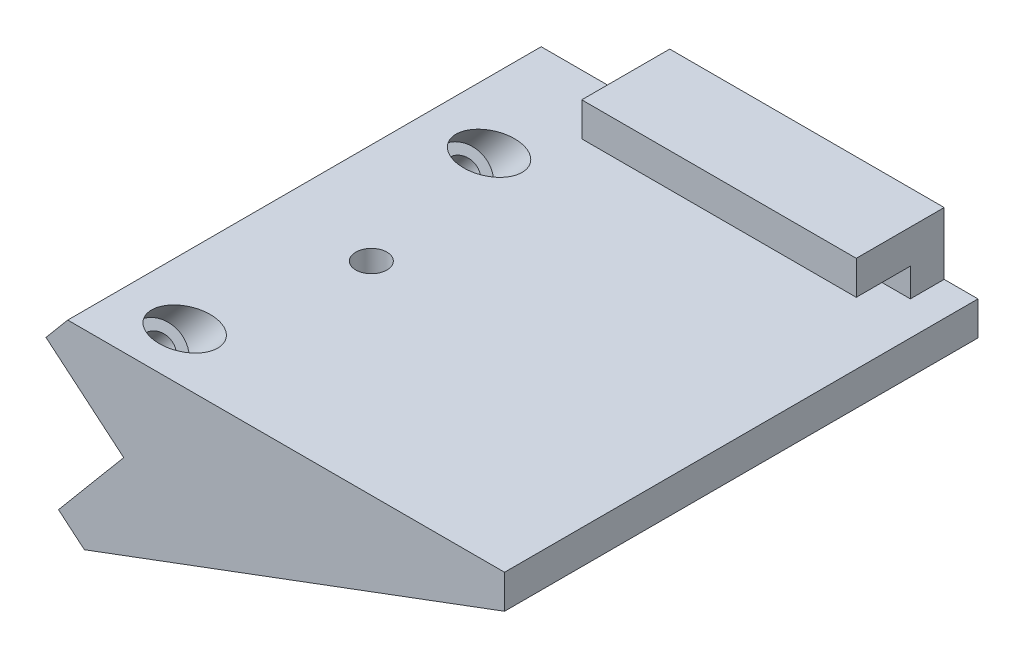
ISO-10303-21;
HEADER;
FILE_DESCRIPTION(('STEP AP214'),'2;1');
FILE_NAME('part.step','',(''),(''),'','','');
FILE_SCHEMA(('AUTOMOTIVE_DESIGN { 1 0 10303 214 1 1 1 1 }'));
ENDSEC;
DATA;
#1=APPLICATION_CONTEXT('core data for automotive mechanical design processes');
#2=APPLICATION_PROTOCOL_DEFINITION('international standard','automotive_design',2000,#1);
#3=PRODUCT_CONTEXT('',#1,'mechanical');
#4=PRODUCT('Part','Part','',(#3));
#5=PRODUCT_RELATED_PRODUCT_CATEGORY('part','',(#4));
#6=PRODUCT_DEFINITION_FORMATION('','',#4);
#7=PRODUCT_DEFINITION_CONTEXT('part definition',#1,'design');
#8=PRODUCT_DEFINITION('design','',#6,#7);
#9=PRODUCT_DEFINITION_SHAPE('','',#8);
#10=(LENGTH_UNIT() NAMED_UNIT(*) SI_UNIT(.MILLI.,.METRE.));
#11=(NAMED_UNIT(*) PLANE_ANGLE_UNIT() SI_UNIT($,.RADIAN.));
#12=(NAMED_UNIT(*) SI_UNIT($,.STERADIAN.) SOLID_ANGLE_UNIT());
#13=UNCERTAINTY_MEASURE_WITH_UNIT(LENGTH_MEASURE(1.E-05),#10,'distance_accuracy_value','');
#14=(GEOMETRIC_REPRESENTATION_CONTEXT(3) GLOBAL_UNCERTAINTY_ASSIGNED_CONTEXT((#13)) GLOBAL_UNIT_ASSIGNED_CONTEXT((#10,
#11,#12)) REPRESENTATION_CONTEXT('',''));
#15=CARTESIAN_POINT('',(0.,0.,0.));
#16=DIRECTION('',(0.,0.,1.));
#17=DIRECTION('',(1.,0.,0.));
#18=AXIS2_PLACEMENT_3D('',#15,#16,#17);
#19=CARTESIAN_POINT('',(0.,0.,0.));
#20=DIRECTION('',(0.,0.,1.));
#21=DIRECTION('',(1.,0.,0.));
#22=AXIS2_PLACEMENT_3D('',#19,#20,#21);
#23=PLANE('',#22);
#24=DIRECTION('',(0.,-1.,0.));
#25=VECTOR('',#24,1.);
#26=CARTESIAN_POINT('',(60.9461948869302,24.9627030076777,0.));
#27=LINE('',#26,#25);
#28=CARTESIAN_POINT('',(60.9461948869302,29.1627030076777,0.));
#29=VERTEX_POINT('',#28);
#30=CARTESIAN_POINT('',(60.9461948869302,24.9627030076777,0.));
#31=VERTEX_POINT('',#30);
#32=EDGE_CURVE('E145',#29,#31,#27,.T.);
#33=ORIENTED_EDGE('',*,*,#32,.F.);
#34=DIRECTION('',(1.,0.,0.));
#35=VECTOR('',#34,1.);
#36=CARTESIAN_POINT('',(65.9461948869302,29.1627030076777,0.));
#37=LINE('',#36,#35);
#38=CARTESIAN_POINT('',(20.364802153777,29.1627030076776,0.));
#39=VERTEX_POINT('',#38);
#40=EDGE_CURVE('E289',#39,#29,#37,.T.);
#41=ORIENTED_EDGE('',*,*,#40,.F.);
#42=DIRECTION('',(0.,1.,0.));
#43=VECTOR('',#42,1.);
#44=CARTESIAN_POINT('',(20.364802153777,0.,0.));
#45=LINE('',#44,#43);
#46=CARTESIAN_POINT('',(20.364802153777,24.9627030076777,0.));
#47=VERTEX_POINT('',#46);
#48=EDGE_CURVE('E156',#47,#39,#45,.T.);
#49=ORIENTED_EDGE('',*,*,#48,.F.);
#50=DIRECTION('',(-1.,0.,0.));
#51=VECTOR('',#50,1.);
#52=CARTESIAN_POINT('',(1.36508554694607,24.9627030076777,0.));
#53=LINE('',#52,#51);
#54=EDGE_CURVE('E139',#31,#47,#53,.T.);
#55=ORIENTED_EDGE('',*,*,#54,.F.);
#56=EDGE_LOOP('',(#33,#41,#49,#55));
#57=FACE_BOUND('',#56,.T.);
#58=ADVANCED_FACE('F41',(#57),#23,.T.);
#59=CARTESIAN_POINT('',(3.8302222155949,-3.21393804843269,65.));
#60=DIRECTION('',(0.642787609686537,0.766044443118979,0.));
#61=DIRECTION('',(-0.76604444311898,0.642787609686537,0.));
#62=AXIS2_PLACEMENT_3D('',#59,#60,#61);
#63=PLANE('',#62);
#64=DIRECTION('',(0.,0.,-1.));
#65=VECTOR('',#64,1.);
#66=CARTESIAN_POINT('',(0.,0.,65.));
#67=LINE('',#66,#65);
#68=CARTESIAN_POINT('',(0.,0.,65.));
#69=VERTEX_POINT('',#68);
#70=CARTESIAN_POINT('',(0.,0.,-5.));
#71=VERTEX_POINT('',#70);
#72=EDGE_CURVE('E170',#69,#71,#67,.T.);
#73=ORIENTED_EDGE('',*,*,#72,.T.);
#74=DIRECTION('',(0.76604444311898,-0.642787609686537,0.));
#75=VECTOR('',#74,1.);
#76=CARTESIAN_POINT('',(0.,0.,-5.));
#77=LINE('',#76,#75);
#78=CARTESIAN_POINT('',(3.8302222155949,-3.21393804843269,-5.));
#79=VERTEX_POINT('',#78);
#80=EDGE_CURVE('E226',#71,#79,#77,.T.);
#81=ORIENTED_EDGE('',*,*,#80,.T.);
#82=DIRECTION('',(0.,0.,-1.));
#83=VECTOR('',#82,1.);
#84=CARTESIAN_POINT('',(3.8302222155949,-3.21393804843269,65.));
#85=LINE('',#84,#83);
#86=CARTESIAN_POINT('',(3.8302222155949,-3.21393804843269,65.));
#87=VERTEX_POINT('',#86);
#88=EDGE_CURVE('E49',#87,#79,#85,.T.);
#89=ORIENTED_EDGE('',*,*,#88,.F.);
#90=DIRECTION('',(0.76604444311898,-0.642787609686537,0.));
#91=VECTOR('',#90,1.);
#92=CARTESIAN_POINT('',(3.8302222155949,-3.21393804843269,65.));
#93=LINE('',#92,#91);
#94=EDGE_CURVE('E157',#69,#87,#93,.T.);
#95=ORIENTED_EDGE('',*,*,#94,.F.);
#96=EDGE_LOOP('',(#73,#81,#89,#95));
#97=FACE_BOUND('',#96,.T.);
#98=ADVANCED_FACE('F43',(#97),#63,.F.);
#99=CARTESIAN_POINT('',(65.9461948869302,19.9627030076777,65.));
#100=DIRECTION('',(-0.349577800367252,0.936907338796315,0.));
#101=DIRECTION('',(-0.936907338796315,-0.349577800367252,0.));
#102=AXIS2_PLACEMENT_3D('',#99,#100,#101);
#103=PLANE('',#102);
#104=ORIENTED_EDGE('',*,*,#88,.T.);
#105=DIRECTION('',(0.936907338796315,0.349577800367252,0.));
#106=VECTOR('',#105,1.);
#107=CARTESIAN_POINT('',(3.8302222155949,-3.21393804843269,-5.));
#108=LINE('',#107,#106);
#109=CARTESIAN_POINT('',(65.9461948869302,19.9627030076777,-5.));
#110=VERTEX_POINT('',#109);
#111=EDGE_CURVE('E232',#79,#110,#108,.T.);
#112=ORIENTED_EDGE('',*,*,#111,.T.);
#113=DIRECTION('',(0.,0.,-1.));
#114=VECTOR('',#113,1.);
#115=CARTESIAN_POINT('',(65.9461948869302,19.9627030076777,65.));
#116=LINE('',#115,#114);
#117=CARTESIAN_POINT('',(65.9461948869302,19.9627030076777,65.));
#118=VERTEX_POINT('',#117);
#119=EDGE_CURVE('E181',#118,#110,#116,.T.);
#120=ORIENTED_EDGE('',*,*,#119,.F.);
#121=DIRECTION('',(0.936907338796315,0.349577800367252,0.));
#122=VECTOR('',#121,1.);
#123=CARTESIAN_POINT('',(65.9461948869302,19.9627030076777,65.));
#124=LINE('',#123,#122);
#125=EDGE_CURVE('E161',#87,#118,#124,.T.);
#126=ORIENTED_EDGE('',*,*,#125,.F.);
#127=EDGE_LOOP('',(#104,#112,#120,#126));
#128=FACE_BOUND('',#127,.T.);
#129=ADVANCED_FACE('F230',(#128),#103,.F.);
#130=CARTESIAN_POINT('',(65.9461948869302,24.9627030076777,65.));
#131=DIRECTION('',(-1.,0.,0.));
#132=DIRECTION('',(0.,-1.,0.));
#133=AXIS2_PLACEMENT_3D('',#130,#131,#132);
#134=PLANE('',#133);
#135=DIRECTION('',(0.,1.,0.));
#136=VECTOR('',#135,1.);
#137=CARTESIAN_POINT('',(65.9461948869302,19.9627030076777,-5.));
#138=LINE('',#137,#136);
#139=CARTESIAN_POINT('',(65.9461948869302,24.9627030076775,-5.));
#140=VERTEX_POINT('',#139);
#141=EDGE_CURVE('E237',#110,#140,#138,.T.);
#142=ORIENTED_EDGE('',*,*,#141,.T.);
#143=DIRECTION('',(0.,0.,-1.));
#144=VECTOR('',#143,1.);
#145=CARTESIAN_POINT('',(65.9461948869302,24.9627030076777,65.));
#146=LINE('',#145,#144);
#147=CARTESIAN_POINT('',(65.9461948869302,24.9627030076777,65.));
#148=VERTEX_POINT('',#147);
#149=EDGE_CURVE('E179',#148,#140,#146,.T.);
#150=ORIENTED_EDGE('',*,*,#149,.F.);
#151=DIRECTION('',(0.,1.,0.));
#152=VECTOR('',#151,1.);
#153=CARTESIAN_POINT('',(65.9461948869302,24.9627030076777,65.));
#154=LINE('',#153,#152);
#155=EDGE_CURVE('E204',#118,#148,#154,.T.);
#156=ORIENTED_EDGE('',*,*,#155,.F.);
#157=ORIENTED_EDGE('',*,*,#119,.T.);
#158=EDGE_LOOP('',(#142,#150,#156,#157));
#159=FACE_BOUND('',#158,.T.);
#160=ADVANCED_FACE('F367',(#159),#134,.F.);
#161=CARTESIAN_POINT('',(1.36508554694607,24.9627030076777,65.));
#162=DIRECTION('',(0.,-1.,0.));
#163=DIRECTION('',(1.,0.,0.));
#164=AXIS2_PLACEMENT_3D('',#161,#162,#163);
#165=PLANE('',#164);
#166=CARTESIAN_POINT('',(16.2550855469461,24.9627030076777,35.));
#167=DIRECTION('',(0.,1.,0.));
#168=DIRECTION('',(-1.,0.,0.));
#169=AXIS2_PLACEMENT_3D('',#166,#167,#168);
#170=CIRCLE('',#169,2.3);
#171=CARTESIAN_POINT('',(13.9550855469461,24.9627030076777,35.));
#172=VERTEX_POINT('',#171);
#173=EDGE_CURVE('E293',#172,#172,#170,.T.);
#174=ORIENTED_EDGE('',*,*,#173,.F.);
#175=EDGE_LOOP('',(#174));
#176=FACE_BOUND('',#175,.T.);
#177=CARTESIAN_POINT('',(11.1556402169381,24.9627030076776,57.5));
#178=DIRECTION('',(0.,-1.,0.));
#179=DIRECTION('',(-1.,0.,0.));
#180=AXIS2_PLACEMENT_3D('',#177,#178,#179);
#181=ELLIPSE('',#180,4.89527733499604,3.75);
#182=CARTESIAN_POINT('',(6.26036288194209,24.9627030076776,57.5));
#183=VERTEX_POINT('',#182);
#184=EDGE_CURVE('E193',#183,#183,#181,.T.);
#185=ORIENTED_EDGE('',*,*,#184,.T.);
#186=EDGE_LOOP('',(#185));
#187=FACE_BOUND('',#186,.T.);
#188=CARTESIAN_POINT('',(11.1556402169381,24.9627030076776,12.5));
#189=DIRECTION('',(0.,-1.,0.));
#190=DIRECTION('',(-1.,0.,0.));
#191=AXIS2_PLACEMENT_3D('',#188,#189,#190);
#192=ELLIPSE('',#191,4.89527733499604,3.75);
#193=CARTESIAN_POINT('',(6.26036288194209,24.9627030076776,12.5));
#194=VERTEX_POINT('',#193);
#195=EDGE_CURVE('E191',#194,#194,#192,.T.);
#196=ORIENTED_EDGE('',*,*,#195,.T.);
#197=EDGE_LOOP('',(#196));
#198=FACE_BOUND('',#197,.T.);
#199=ORIENTED_EDGE('',*,*,#149,.T.);
#200=DIRECTION('',(1.,0.,0.));
#201=VECTOR('',#200,1.);
#202=CARTESIAN_POINT('',(60.9461948869302,24.9627030076775,-5.));
#203=LINE('',#202,#201);
#204=CARTESIAN_POINT('',(60.9461948869302,24.9627030076775,-5.));
#205=VERTEX_POINT('',#204);
#206=EDGE_CURVE('E142',#205,#140,#203,.T.);
#207=ORIENTED_EDGE('',*,*,#206,.F.);
#208=DIRECTION('',(0.,0.,-1.));
#209=VECTOR('',#208,1.);
#210=CARTESIAN_POINT('',(60.9461948869302,24.9627030076777,0.));
#211=LINE('',#210,#209);
#212=EDGE_CURVE('E135',#31,#205,#211,.T.);
#213=ORIENTED_EDGE('',*,*,#212,.F.);
#214=ORIENTED_EDGE('',*,*,#54,.T.);
#215=DIRECTION('',(0.,0.,1.));
#216=VECTOR('',#215,1.);
#217=CARTESIAN_POINT('',(20.364802153777,24.9627030076777,-5.));
#218=LINE('',#217,#216);
#219=CARTESIAN_POINT('',(20.364802153777,24.9627030076777,-5.));
#220=VERTEX_POINT('',#219);
#221=EDGE_CURVE('E301',#220,#47,#218,.T.);
#222=ORIENTED_EDGE('',*,*,#221,.F.);
#223=DIRECTION('',(1.,0.,0.));
#224=VECTOR('',#223,1.);
#225=CARTESIAN_POINT('',(1.36508554694607,24.9627030076777,-5.));
#226=LINE('',#225,#224);
#227=CARTESIAN_POINT('',(1.36508554694607,24.9627030076777,-5.));
#228=VERTEX_POINT('',#227);
#229=EDGE_CURVE('E308',#228,#220,#226,.T.);
#230=ORIENTED_EDGE('',*,*,#229,.F.);
#231=DIRECTION('',(0.,0.,-1.));
#232=VECTOR('',#231,1.);
#233=CARTESIAN_POINT('',(1.36508554694607,24.9627030076777,65.));
#234=LINE('',#233,#232);
#235=CARTESIAN_POINT('',(1.36508554694607,24.9627030076777,65.));
#236=VERTEX_POINT('',#235);
#237=EDGE_CURVE('E177',#236,#228,#234,.T.);
#238=ORIENTED_EDGE('',*,*,#237,.F.);
#239=DIRECTION('',(-1.,0.,0.));
#240=VECTOR('',#239,1.);
#241=CARTESIAN_POINT('',(1.36508554694607,24.9627030076777,65.));
#242=LINE('',#241,#240);
#243=EDGE_CURVE('E206',#148,#236,#242,.T.);
#244=ORIENTED_EDGE('',*,*,#243,.F.);
#245=EDGE_LOOP('',(#199,#207,#213,#214,#222,#230,#238,#244));
#246=FACE_BOUND('',#245,.T.);
#247=ADVANCED_FACE('F137',(#176,#187,#198,#246),#165,.F.);
#248=CARTESIAN_POINT('',(-1.84885250148662,21.1324807920828,65.));
#249=DIRECTION('',(0.766044443118979,-0.642787609686538,0.));
#250=DIRECTION('',(0.642787609686538,0.76604444311898,0.));
#251=AXIS2_PLACEMENT_3D('',#248,#249,#250);
#252=PLANE('',#251);
#253=ORIENTED_EDGE('',*,*,#237,.T.);
#254=DIRECTION('',(-0.642787609686538,-0.766044443118979,0.));
#255=VECTOR('',#254,1.);
#256=CARTESIAN_POINT('',(9.08480215377701,34.1627030076776,-5.));
#257=LINE('',#256,#255);
#258=CARTESIAN_POINT('',(-1.84885250148662,21.1324807920828,-5.));
#259=VERTEX_POINT('',#258);
#260=EDGE_CURVE('E245',#228,#259,#257,.T.);
#261=ORIENTED_EDGE('',*,*,#260,.T.);
#262=DIRECTION('',(0.,0.,-1.));
#263=VECTOR('',#262,1.);
#264=CARTESIAN_POINT('',(-1.84885250148662,21.1324807920828,65.));
#265=LINE('',#264,#263);
#266=CARTESIAN_POINT('',(-1.84885250148662,21.1324807920828,65.));
#267=VERTEX_POINT('',#266);
#268=EDGE_CURVE('E174',#267,#259,#265,.T.);
#269=ORIENTED_EDGE('',*,*,#268,.F.);
#270=DIRECTION('',(-0.642787609686538,-0.766044443118979,0.));
#271=VECTOR('',#270,1.);
#272=CARTESIAN_POINT('',(-1.84885250148662,21.1324807920828,65.));
#273=LINE('',#272,#271);
#274=EDGE_CURVE('E208',#236,#267,#273,.T.);
#275=ORIENTED_EDGE('',*,*,#274,.F.);
#276=EDGE_LOOP('',(#253,#261,#269,#275));
#277=FACE_BOUND('',#276,.T.);
#278=ADVANCED_FACE('F275',(#277),#252,.F.);
#279=CARTESIAN_POINT('',(9.64181414529807,11.4906666467847,65.));
#280=DIRECTION('',(0.642787609686538,0.766044443118979,0.));
#281=DIRECTION('',(-0.766044443118979,0.642787609686538,0.));
#282=AXIS2_PLACEMENT_3D('',#279,#280,#281);
#283=PLANE('',#282);
#284=CARTESIAN_POINT('',(3.89648082190573,16.3115737194337,12.5));
#285=DIRECTION('',(-0.642787609686538,-0.766044443118979,0.));
#286=DIRECTION('',(0.766044443118979,-0.642787609686538,0.));
#287=AXIS2_PLACEMENT_3D('',#284,#285,#286);
#288=CIRCLE('',#287,2.25);
#289=CARTESIAN_POINT('',(5.62008081892343,14.865301597639,12.5));
#290=VERTEX_POINT('',#289);
#291=EDGE_CURVE('E158',#290,#290,#288,.T.);
#292=ORIENTED_EDGE('',*,*,#291,.F.);
#293=EDGE_LOOP('',(#292));
#294=FACE_BOUND('',#293,.T.);
#295=CARTESIAN_POINT('',(3.89648082190573,16.3115737194337,57.5));
#296=DIRECTION('',(-0.642787609686538,-0.766044443118979,0.));
#297=DIRECTION('',(0.766044443118979,-0.642787609686538,0.));
#298=AXIS2_PLACEMENT_3D('',#295,#296,#297);
#299=CIRCLE('',#298,2.25);
#300=CARTESIAN_POINT('',(5.62008081892343,14.865301597639,57.5));
#301=VERTEX_POINT('',#300);
#302=EDGE_CURVE('E164',#301,#301,#299,.T.);
#303=ORIENTED_EDGE('',*,*,#302,.F.);
#304=EDGE_LOOP('',(#303));
#305=FACE_BOUND('',#304,.T.);
#306=ORIENTED_EDGE('',*,*,#268,.T.);
#307=DIRECTION('',(0.766044443118979,-0.642787609686538,0.));
#308=VECTOR('',#307,1.);
#309=CARTESIAN_POINT('',(-1.84885250148662,21.1324807920828,-5.));
#310=LINE('',#309,#308);
#311=CARTESIAN_POINT('',(9.64181414529807,11.4906666467847,-5.));
#312=VERTEX_POINT('',#311);
#313=EDGE_CURVE('E247',#259,#312,#310,.T.);
#314=ORIENTED_EDGE('',*,*,#313,.T.);
#315=DIRECTION('',(0.,0.,-1.));
#316=VECTOR('',#315,1.);
#317=CARTESIAN_POINT('',(9.64181414529807,11.4906666467847,65.));
#318=LINE('',#317,#316);
#319=CARTESIAN_POINT('',(9.64181414529807,11.4906666467847,65.));
#320=VERTEX_POINT('',#319);
#321=EDGE_CURVE('E172',#320,#312,#318,.T.);
#322=ORIENTED_EDGE('',*,*,#321,.F.);
#323=DIRECTION('',(0.766044443118979,-0.642787609686538,0.));
#324=VECTOR('',#323,1.);
#325=CARTESIAN_POINT('',(9.64181414529807,11.4906666467847,65.));
#326=LINE('',#325,#324);
#327=EDGE_CURVE('E209',#267,#320,#326,.T.);
#328=ORIENTED_EDGE('',*,*,#327,.F.);
#329=EDGE_LOOP('',(#306,#314,#322,#328));
#330=FACE_BOUND('',#329,.T.);
#331=ADVANCED_FACE('F272',(#294,#305,#330),#283,.F.);
#332=CARTESIAN_POINT('',(0.,0.,65.));
#333=DIRECTION('',(0.766044443118979,-0.642787609686538,0.));
#334=DIRECTION('',(0.642787609686538,0.766044443118979,0.));
#335=AXIS2_PLACEMENT_3D('',#332,#333,#334);
#336=PLANE('',#335);
#337=ORIENTED_EDGE('',*,*,#321,.T.);
#338=DIRECTION('',(-0.642787609686538,-0.766044443118979,0.));
#339=VECTOR('',#338,1.);
#340=CARTESIAN_POINT('',(9.64181414529807,11.4906666467847,-5.));
#341=LINE('',#340,#339);
#342=EDGE_CURVE('E222',#312,#71,#341,.T.);
#343=ORIENTED_EDGE('',*,*,#342,.T.);
#344=ORIENTED_EDGE('',*,*,#72,.F.);
#345=DIRECTION('',(-0.642787609686538,-0.766044443118979,0.));
#346=VECTOR('',#345,1.);
#347=CARTESIAN_POINT('',(0.,0.,65.));
#348=LINE('',#347,#346);
#349=EDGE_CURVE('E168',#320,#69,#348,.T.);
#350=ORIENTED_EDGE('',*,*,#349,.F.);
#351=EDGE_LOOP('',(#337,#343,#344,#350));
#352=FACE_BOUND('',#351,.T.);
#353=ADVANCED_FACE('F220',(#352),#336,.F.);
#354=CARTESIAN_POINT('',(0.,0.,65.));
#355=DIRECTION('',(0.,0.,-1.));
#356=DIRECTION('',(-1.,0.,0.));
#357=AXIS2_PLACEMENT_3D('',#354,#355,#356);
#358=PLANE('',#357);
#359=ORIENTED_EDGE('',*,*,#94,.T.);
#360=ORIENTED_EDGE('',*,*,#125,.T.);
#361=ORIENTED_EDGE('',*,*,#155,.T.);
#362=ORIENTED_EDGE('',*,*,#243,.T.);
#363=ORIENTED_EDGE('',*,*,#274,.T.);
#364=ORIENTED_EDGE('',*,*,#327,.T.);
#365=ORIENTED_EDGE('',*,*,#349,.T.);
#366=EDGE_LOOP('',(#359,#360,#361,#362,#363,#364,#365));
#367=FACE_BOUND('',#366,.T.);
#368=ADVANCED_FACE('F215',(#367),#358,.F.);
#369=CARTESIAN_POINT('',(32.1791356481134,50.0175292166688,57.5));
#370=DIRECTION('',(-0.642787609686538,-0.766044443118979,0.));
#371=DIRECTION('',(0.766044443118979,-0.642787609686538,0.));
#372=AXIS2_PLACEMENT_3D('',#369,#370,#371);
#373=CYLINDRICAL_SURFACE('',#372,2.25);
#374=CARTESIAN_POINT('',(7.11041887033841,20.1417959350286,57.5));
#375=DIRECTION('',(-0.642787609686538,-0.766044443118979,0.));
#376=DIRECTION('',(0.766044443118979,-0.642787609686538,0.));
#377=AXIS2_PLACEMENT_3D('',#374,#375,#376);
#378=CIRCLE('',#377,2.25);
#379=CARTESIAN_POINT('',(8.83401886735612,18.6955238132339,57.5));
#380=VERTEX_POINT('',#379);
#381=EDGE_CURVE('E187',#380,#380,#378,.F.);
#382=ORIENTED_EDGE('',*,*,#381,.T.);
#383=EDGE_LOOP('',(#382));
#384=FACE_BOUND('',#383,.T.);
#385=ORIENTED_EDGE('',*,*,#302,.T.);
#386=EDGE_LOOP('',(#385));
#387=FACE_BOUND('',#386,.T.);
#388=ADVANCED_FACE('F268',(#384,#387),#373,.F.);
#389=CARTESIAN_POINT('',(32.1791356481134,50.0175292166688,12.5));
#390=DIRECTION('',(-0.642787609686538,-0.766044443118979,0.));
#391=DIRECTION('',(0.766044443118979,-0.642787609686538,0.));
#392=AXIS2_PLACEMENT_3D('',#389,#390,#391);
#393=CYLINDRICAL_SURFACE('',#392,2.25);
#394=CARTESIAN_POINT('',(7.11041887033841,20.1417959350286,12.5));
#395=DIRECTION('',(-0.642787609686538,-0.766044443118979,0.));
#396=DIRECTION('',(0.766044443118979,-0.642787609686538,0.));
#397=AXIS2_PLACEMENT_3D('',#394,#395,#396);
#398=CIRCLE('',#397,2.25);
#399=CARTESIAN_POINT('',(8.83401886735612,18.6955238132339,12.5));
#400=VERTEX_POINT('',#399);
#401=EDGE_CURVE('E184',#400,#400,#398,.F.);
#402=ORIENTED_EDGE('',*,*,#401,.T.);
#403=EDGE_LOOP('',(#402));
#404=FACE_BOUND('',#403,.T.);
#405=ORIENTED_EDGE('',*,*,#291,.T.);
#406=EDGE_LOOP('',(#405));
#407=FACE_BOUND('',#406,.T.);
#408=ADVANCED_FACE('F265',(#404,#407),#393,.F.);
#409=CARTESIAN_POINT('',(35.3930736965461,53.8477514322637,12.5));
#410=DIRECTION('',(-0.642787609686538,-0.766044443118979,0.));
#411=DIRECTION('',(0.766044443118979,-0.642787609686538,0.));
#412=AXIS2_PLACEMENT_3D('',#409,#410,#411);
#413=CYLINDRICAL_SURFACE('',#412,3.75);
#414=CARTESIAN_POINT('',(7.11041887033841,20.1417959350286,12.5));
#415=DIRECTION('',(-0.642787609686538,-0.766044443118979,0.));
#416=DIRECTION('',(0.766044443118979,-0.642787609686538,0.));
#417=AXIS2_PLACEMENT_3D('',#414,#415,#416);
#418=CIRCLE('',#417,3.75);
#419=CARTESIAN_POINT('',(9.98308553203458,17.7313423987041,12.5));
#420=VERTEX_POINT('',#419);
#421=EDGE_CURVE('E250',#420,#420,#418,.T.);
#422=ORIENTED_EDGE('',*,*,#421,.T.);
#423=EDGE_LOOP('',(#422));
#424=FACE_BOUND('',#423,.T.);
#425=ORIENTED_EDGE('',*,*,#195,.F.);
#426=EDGE_LOOP('',(#425));
#427=FACE_BOUND('',#426,.T.);
#428=ADVANCED_FACE('F255',(#424,#427),#413,.F.);
#429=CARTESIAN_POINT('',(7.11041887033841,20.1417959350286,12.5));
#430=DIRECTION('',(-0.642787609686538,-0.766044443118979,0.));
#431=DIRECTION('',(0.766044443118979,-0.642787609686538,0.));
#432=AXIS2_PLACEMENT_3D('',#429,#430,#431);
#433=PLANE('',#432);
#434=ORIENTED_EDGE('',*,*,#421,.F.);
#435=EDGE_LOOP('',(#434));
#436=FACE_BOUND('',#435,.T.);
#437=ORIENTED_EDGE('',*,*,#401,.F.);
#438=EDGE_LOOP('',(#437));
#439=FACE_BOUND('',#438,.T.);
#440=ADVANCED_FACE('F258',(#436,#439),#433,.F.);
#441=CARTESIAN_POINT('',(35.3930736965461,53.8477514322637,57.5));
#442=DIRECTION('',(-0.642787609686538,-0.766044443118979,0.));
#443=DIRECTION('',(0.766044443118979,-0.642787609686538,0.));
#444=AXIS2_PLACEMENT_3D('',#441,#442,#443);
#445=CYLINDRICAL_SURFACE('',#444,3.75);
#446=CARTESIAN_POINT('',(7.11041887033841,20.1417959350286,57.5));
#447=DIRECTION('',(-0.642787609686538,-0.766044443118979,0.));
#448=DIRECTION('',(0.766044443118979,-0.642787609686538,0.));
#449=AXIS2_PLACEMENT_3D('',#446,#447,#448);
#450=CIRCLE('',#449,3.75);
#451=CARTESIAN_POINT('',(9.98308553203458,17.7313423987041,57.5));
#452=VERTEX_POINT('',#451);
#453=EDGE_CURVE('E188',#452,#452,#450,.T.);
#454=ORIENTED_EDGE('',*,*,#453,.T.);
#455=EDGE_LOOP('',(#454));
#456=FACE_BOUND('',#455,.T.);
#457=ORIENTED_EDGE('',*,*,#184,.F.);
#458=EDGE_LOOP('',(#457));
#459=FACE_BOUND('',#458,.T.);
#460=ADVANCED_FACE('F261',(#456,#459),#445,.F.);
#461=CARTESIAN_POINT('',(7.11041887033841,20.1417959350286,57.5));
#462=DIRECTION('',(-0.642787609686538,-0.766044443118979,0.));
#463=DIRECTION('',(0.766044443118979,-0.642787609686538,0.));
#464=AXIS2_PLACEMENT_3D('',#461,#462,#463);
#465=PLANE('',#464);
#466=ORIENTED_EDGE('',*,*,#453,.F.);
#467=EDGE_LOOP('',(#466));
#468=FACE_BOUND('',#467,.T.);
#469=ORIENTED_EDGE('',*,*,#381,.F.);
#470=EDGE_LOOP('',(#469));
#471=FACE_BOUND('',#470,.T.);
#472=ADVANCED_FACE('F347',(#468,#471),#465,.F.);
#473=CARTESIAN_POINT('',(65.9461948869302,34.1627030076776,-5.));
#474=DIRECTION('',(0.,1.,0.));
#475=DIRECTION('',(0.,0.,1.));
#476=AXIS2_PLACEMENT_3D('',#473,#474,#475);
#477=PLANE('',#476);
#478=DIRECTION('',(0.,0.,1.));
#479=VECTOR('',#478,1.);
#480=CARTESIAN_POINT('',(60.9461948869302,34.1627030076777,-5.));
#481=LINE('',#480,#479);
#482=CARTESIAN_POINT('',(60.9461948869302,34.1627030076777,-5.));
#483=VERTEX_POINT('',#482);
#484=CARTESIAN_POINT('',(60.9461948869302,34.1627030076776,8.));
#485=VERTEX_POINT('',#484);
#486=EDGE_CURVE('E56',#483,#485,#481,.T.);
#487=ORIENTED_EDGE('',*,*,#486,.F.);
#488=DIRECTION('',(-1.,0.,0.));
#489=VECTOR('',#488,1.);
#490=CARTESIAN_POINT('',(65.9461948869302,34.1627030076776,-5.));
#491=LINE('',#490,#489);
#492=CARTESIAN_POINT('',(20.364802153777,34.1627030076776,-5.));
#493=VERTEX_POINT('',#492);
#494=EDGE_CURVE('E239',#483,#493,#491,.T.);
#495=ORIENTED_EDGE('',*,*,#494,.T.);
#496=DIRECTION('',(0.,0.,1.));
#497=VECTOR('',#496,1.);
#498=CARTESIAN_POINT('',(20.364802153777,34.1627030076776,-5.));
#499=LINE('',#498,#497);
#500=CARTESIAN_POINT('',(20.364802153777,34.1627030076776,8.));
#501=VERTEX_POINT('',#500);
#502=EDGE_CURVE('E300',#493,#501,#499,.T.);
#503=ORIENTED_EDGE('',*,*,#502,.T.);
#504=DIRECTION('',(-1.,0.,0.));
#505=VECTOR('',#504,1.);
#506=CARTESIAN_POINT('',(9.08480215377701,34.1627030076776,8.));
#507=LINE('',#506,#505);
#508=EDGE_CURVE('E286',#485,#501,#507,.T.);
#509=ORIENTED_EDGE('',*,*,#508,.F.);
#510=EDGE_LOOP('',(#487,#495,#503,#509));
#511=FACE_BOUND('',#510,.T.);
#512=ADVANCED_FACE('F318',(#511),#477,.T.);
#513=CARTESIAN_POINT('',(0.,0.,-5.));
#514=DIRECTION('',(0.,0.,1.));
#515=DIRECTION('',(1.,0.,0.));
#516=AXIS2_PLACEMENT_3D('',#513,#514,#515);
#517=PLANE('',#516);
#518=DIRECTION('',(0.,1.,0.));
#519=VECTOR('',#518,1.);
#520=CARTESIAN_POINT('',(60.9461948869302,24.9627030076775,-5.));
#521=LINE('',#520,#519);
#522=EDGE_CURVE('E144',#205,#483,#521,.T.);
#523=ORIENTED_EDGE('',*,*,#522,.F.);
#524=ORIENTED_EDGE('',*,*,#206,.T.);
#525=ORIENTED_EDGE('',*,*,#141,.F.);
#526=ORIENTED_EDGE('',*,*,#111,.F.);
#527=ORIENTED_EDGE('',*,*,#80,.F.);
#528=ORIENTED_EDGE('',*,*,#342,.F.);
#529=ORIENTED_EDGE('',*,*,#313,.F.);
#530=ORIENTED_EDGE('',*,*,#260,.F.);
#531=ORIENTED_EDGE('',*,*,#229,.T.);
#532=DIRECTION('',(0.,1.,0.));
#533=VECTOR('',#532,1.);
#534=CARTESIAN_POINT('',(20.364802153777,24.9627030076777,-5.));
#535=LINE('',#534,#533);
#536=EDGE_CURVE('E303',#220,#493,#535,.T.);
#537=ORIENTED_EDGE('',*,*,#536,.T.);
#538=ORIENTED_EDGE('',*,*,#494,.F.);
#539=EDGE_LOOP('',(#523,#524,#525,#526,#527,#528,#529,#530,#531,#537,#538));
#540=FACE_BOUND('',#539,.T.);
#541=ADVANCED_FACE('F235',(#540),#517,.F.);
#542=CARTESIAN_POINT('',(65.9461948869302,29.1627030076777,8.));
#543=DIRECTION('',(0.,1.,0.));
#544=DIRECTION('',(-1.,0.,0.));
#545=AXIS2_PLACEMENT_3D('',#542,#543,#544);
#546=PLANE('',#545);
#547=ORIENTED_EDGE('',*,*,#40,.T.);
#548=DIRECTION('',(0.,0.,-1.));
#549=VECTOR('',#548,1.);
#550=CARTESIAN_POINT('',(60.9461948869302,29.1627030076777,8.));
#551=LINE('',#550,#549);
#552=CARTESIAN_POINT('',(60.9461948869302,29.1627030076777,8.));
#553=VERTEX_POINT('',#552);
#554=EDGE_CURVE('E150',#553,#29,#551,.T.);
#555=ORIENTED_EDGE('',*,*,#554,.F.);
#556=DIRECTION('',(1.,0.,0.));
#557=VECTOR('',#556,1.);
#558=CARTESIAN_POINT('',(65.9461948869302,29.1627030076777,8.));
#559=LINE('',#558,#557);
#560=CARTESIAN_POINT('',(20.364802153777,29.1627030076776,8.));
#561=VERTEX_POINT('',#560);
#562=EDGE_CURVE('E284',#561,#553,#559,.T.);
#563=ORIENTED_EDGE('',*,*,#562,.F.);
#564=DIRECTION('',(0.,0.,-1.));
#565=VECTOR('',#564,1.);
#566=CARTESIAN_POINT('',(20.364802153777,29.1627030076776,8.));
#567=LINE('',#566,#565);
#568=EDGE_CURVE('E64',#561,#39,#567,.T.);
#569=ORIENTED_EDGE('',*,*,#568,.T.);
#570=EDGE_LOOP('',(#547,#555,#563,#569));
#571=FACE_BOUND('',#570,.T.);
#572=ADVANCED_FACE('F327',(#571),#546,.F.);
#573=CARTESIAN_POINT('',(0.,0.,8.));
#574=DIRECTION('',(0.,0.,-1.));
#575=DIRECTION('',(-1.,0.,0.));
#576=AXIS2_PLACEMENT_3D('',#573,#574,#575);
#577=PLANE('',#576);
#578=ORIENTED_EDGE('',*,*,#562,.T.);
#579=DIRECTION('',(0.,-1.,0.));
#580=VECTOR('',#579,1.);
#581=CARTESIAN_POINT('',(60.9461948869302,29.1627030076777,8.));
#582=LINE('',#581,#580);
#583=EDGE_CURVE('E312',#485,#553,#582,.T.);
#584=ORIENTED_EDGE('',*,*,#583,.F.);
#585=ORIENTED_EDGE('',*,*,#508,.T.);
#586=DIRECTION('',(0.,-1.,0.));
#587=VECTOR('',#586,1.);
#588=CARTESIAN_POINT('',(20.364802153777,0.,8.));
#589=LINE('',#588,#587);
#590=EDGE_CURVE('E11',#501,#561,#589,.T.);
#591=ORIENTED_EDGE('',*,*,#590,.T.);
#592=EDGE_LOOP('',(#578,#584,#585,#591));
#593=FACE_BOUND('',#592,.T.);
#594=ADVANCED_FACE('F325',(#593),#577,.F.);
#595=CARTESIAN_POINT('',(16.2550855469461,21.4627030076777,35.));
#596=DIRECTION('',(0.,1.,0.));
#597=DIRECTION('',(-1.,0.,0.));
#598=AXIS2_PLACEMENT_3D('',#595,#596,#597);
#599=CYLINDRICAL_SURFACE('',#598,2.3);
#600=CARTESIAN_POINT('',(16.2550855469461,21.4627030076777,35.));
#601=DIRECTION('',(0.,1.,0.));
#602=DIRECTION('',(-1.,0.,0.));
#603=AXIS2_PLACEMENT_3D('',#600,#601,#602);
#604=CIRCLE('',#603,2.3);
#605=CARTESIAN_POINT('',(13.9550855469461,21.4627030076777,35.));
#606=VERTEX_POINT('',#605);
#607=EDGE_CURVE('E290',#606,#606,#604,.T.);
#608=ORIENTED_EDGE('',*,*,#607,.F.);
#609=EDGE_LOOP('',(#608));
#610=FACE_BOUND('',#609,.T.);
#611=ORIENTED_EDGE('',*,*,#173,.T.);
#612=EDGE_LOOP('',(#611));
#613=FACE_BOUND('',#612,.T.);
#614=ADVANCED_FACE('F334',(#610,#613),#599,.F.);
#615=CARTESIAN_POINT('',(16.2550855469461,21.4627030076777,35.));
#616=DIRECTION('',(0.,1.,0.));
#617=DIRECTION('',(-1.,0.,0.));
#618=AXIS2_PLACEMENT_3D('',#615,#616,#617);
#619=PLANE('',#618);
#620=ORIENTED_EDGE('',*,*,#607,.T.);
#621=EDGE_LOOP('',(#620));
#622=FACE_BOUND('',#621,.T.);
#623=ADVANCED_FACE('F395',(#622),#619,.T.);
#624=CARTESIAN_POINT('',(20.364802153777,24.9627030076777,-5.));
#625=DIRECTION('',(1.,0.,0.));
#626=DIRECTION('',(0.,0.,-1.));
#627=AXIS2_PLACEMENT_3D('',#624,#625,#626);
#628=PLANE('',#627);
#629=ORIENTED_EDGE('',*,*,#48,.T.);
#630=ORIENTED_EDGE('',*,*,#568,.F.);
#631=ORIENTED_EDGE('',*,*,#590,.F.);
#632=ORIENTED_EDGE('',*,*,#502,.F.);
#633=ORIENTED_EDGE('',*,*,#536,.F.);
#634=ORIENTED_EDGE('',*,*,#221,.T.);
#635=EDGE_LOOP('',(#629,#630,#631,#632,#633,#634));
#636=FACE_BOUND('',#635,.T.);
#637=ADVANCED_FACE('F322',(#636),#628,.F.);
#638=CARTESIAN_POINT('',(60.9461948869301,-2.0402395013828E-13,0.));
#639=DIRECTION('',(-1.,0.,0.));
#640=DIRECTION('',(0.,-1.,0.));
#641=AXIS2_PLACEMENT_3D('',#638,#639,#640);
#642=PLANE('',#641);
#643=ORIENTED_EDGE('',*,*,#32,.T.);
#644=ORIENTED_EDGE('',*,*,#212,.T.);
#645=ORIENTED_EDGE('',*,*,#522,.T.);
#646=ORIENTED_EDGE('',*,*,#486,.T.);
#647=ORIENTED_EDGE('',*,*,#583,.T.);
#648=ORIENTED_EDGE('',*,*,#554,.T.);
#649=EDGE_LOOP('',(#643,#644,#645,#646,#647,#648));
#650=FACE_BOUND('',#649,.T.);
#651=ADVANCED_FACE('F148',(#650),#642,.F.);
#652=CLOSED_SHELL('',(#58,#98,#129,#160,#247,#278,#331,#353,#368,#388,#408,#428,#440,#460,#472,
#512,#541,#572,#594,#614,#623,#637,#651));
#653=MANIFOLD_SOLID_BREP('B2',#652);
#654=ADVANCED_BREP_SHAPE_REPRESENTATION('',(#18,#653),#14);
#655=SHAPE_DEFINITION_REPRESENTATION(#9,#654);
ENDSEC;
END-ISO-10303-21;
